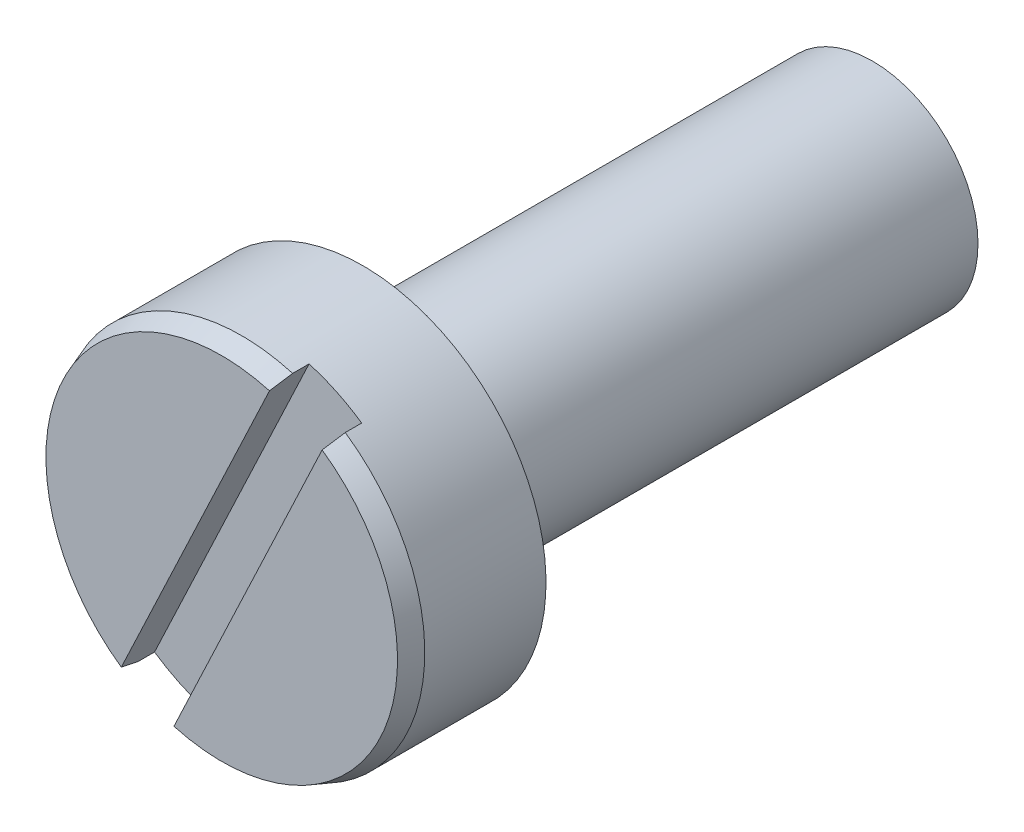
ISO-10303-21;
HEADER;
FILE_DESCRIPTION(('STEP AP214'),'2;1');
FILE_NAME('part.step','',(''),(''),'','','');
FILE_SCHEMA(('AUTOMOTIVE_DESIGN { 1 0 10303 214 1 1 1 1 }'));
ENDSEC;
DATA;
#1=APPLICATION_CONTEXT('core data for automotive mechanical design processes');
#2=APPLICATION_PROTOCOL_DEFINITION('international standard','automotive_design',2000,#1);
#3=PRODUCT_CONTEXT('',#1,'mechanical');
#4=PRODUCT('Part','Part','',(#3));
#5=PRODUCT_RELATED_PRODUCT_CATEGORY('part','',(#4));
#6=PRODUCT_DEFINITION_FORMATION('','',#4);
#7=PRODUCT_DEFINITION_CONTEXT('part definition',#1,'design');
#8=PRODUCT_DEFINITION('design','',#6,#7);
#9=PRODUCT_DEFINITION_SHAPE('','',#8);
#10=(LENGTH_UNIT() NAMED_UNIT(*) SI_UNIT(.MILLI.,.METRE.));
#11=(NAMED_UNIT(*) PLANE_ANGLE_UNIT() SI_UNIT($,.RADIAN.));
#12=(NAMED_UNIT(*) SI_UNIT($,.STERADIAN.) SOLID_ANGLE_UNIT());
#13=UNCERTAINTY_MEASURE_WITH_UNIT(LENGTH_MEASURE(1.E-05),#10,'distance_accuracy_value','');
#14=(GEOMETRIC_REPRESENTATION_CONTEXT(3) GLOBAL_UNCERTAINTY_ASSIGNED_CONTEXT((#13)) GLOBAL_UNIT_ASSIGNED_CONTEXT((#10,
#11,#12)) REPRESENTATION_CONTEXT('',''));
#15=CARTESIAN_POINT('',(0.,0.,0.));
#16=DIRECTION('',(0.,0.,1.));
#17=DIRECTION('',(1.,0.,0.));
#18=AXIS2_PLACEMENT_3D('',#15,#16,#17);
#19=CARTESIAN_POINT('',(7.63219809679219,-23.3190386158975,19.8000000000004));
#20=DIRECTION('',(0.,0.,-1.));
#21=DIRECTION('',(0.427457329703379,0.904035525453982,0.));
#22=AXIS2_PLACEMENT_3D('',#19,#20,#21);
#23=TOROIDAL_SURFACE('',#22,1.95,0.5);
#24=CARTESIAN_POINT('',(7.63219809679219,-23.3190386158975,19.8000000000004));
#25=DIRECTION('',(0.,0.,-1.));
#26=DIRECTION('',(0.427457329703379,0.904035525453982,0.));
#27=AXIS2_PLACEMENT_3D('',#24,#25,#26);
#28=CIRCLE('',#27,1.45);
#29=CARTESIAN_POINT('',(8.25201122486209,-22.0081871039892,19.8000000000004));
#30=VERTEX_POINT('',#29);
#31=EDGE_CURVE('E11',#30,#30,#28,.T.);
#32=ORIENTED_EDGE('',*,*,#31,.F.);
#33=EDGE_LOOP('',(#32));
#34=FACE_BOUND('',#33,.T.);
#35=CARTESIAN_POINT('',(7.63219809679219,-23.3190386158968,20.3000000000004));
#36=DIRECTION('',(0.,0.,1.));
#37=DIRECTION('',(0.427457329703379,0.904035525453982,0.));
#38=AXIS2_PLACEMENT_3D('',#35,#36,#37);
#39=CIRCLE('',#38,1.95);
#40=CARTESIAN_POINT('',(8.46573988971378,-21.5561693412615,20.3000000000004));
#41=VERTEX_POINT('',#40);
#42=EDGE_CURVE('E125',#41,#41,#39,.T.);
#43=ORIENTED_EDGE('',*,*,#42,.F.);
#44=EDGE_LOOP('',(#43));
#45=FACE_BOUND('',#44,.T.);
#46=ADVANCED_FACE('F17',(#34,#45),#23,.F.);
#47=CARTESIAN_POINT('',(7.63219809679219,-23.3190386158966,13.3000000000004));
#48=DIRECTION('',(0.,0.,1.));
#49=DIRECTION('',(-0.427457329703379,-0.904035525453982,0.));
#50=AXIS2_PLACEMENT_3D('',#47,#48,#49);
#51=CONICAL_SURFACE('',#50,1.175252258055,1.221730476396);
#52=CARTESIAN_POINT('',(7.63219809679219,-23.3190386158966,13.3000000000004));
#53=DIRECTION('',(0.,0.,-1.));
#54=DIRECTION('',(0.427457329703379,0.904035525453982,0.));
#55=AXIS2_PLACEMENT_3D('',#52,#53,#54);
#56=CIRCLE('',#55,1.175252258055);
#57=CARTESIAN_POINT('',(8.13456828874825,-22.2565688232449,13.3000000000004));
#58=VERTEX_POINT('',#57);
#59=EDGE_CURVE('E110',#58,#58,#56,.T.);
#60=ORIENTED_EDGE('',*,*,#59,.F.);
#61=EDGE_LOOP('',(#60));
#62=FACE_BOUND('',#61,.T.);
#63=CARTESIAN_POINT('',(7.63219809679219,-23.3190386158975,13.4000000000004));
#64=DIRECTION('',(0.,0.,1.));
#65=DIRECTION('',(0.427457329703379,0.904035525453982,0.));
#66=AXIS2_PLACEMENT_3D('',#63,#64,#65);
#67=CIRCLE('',#66,1.45);
#68=CARTESIAN_POINT('',(8.25201122486209,-22.0081871039892,13.4000000000004));
#69=VERTEX_POINT('',#68);
#70=EDGE_CURVE('E26',#69,#69,#67,.T.);
#71=ORIENTED_EDGE('',*,*,#70,.F.);
#72=EDGE_LOOP('',(#71));
#73=FACE_BOUND('',#72,.T.);
#74=ADVANCED_FACE('F181',(#62,#73),#51,.T.);
#75=CARTESIAN_POINT('',(7.63219809679219,-23.3190386158968,20.3000000000004));
#76=DIRECTION('',(0.,0.,1.));
#77=DIRECTION('',(-0.427457329703379,-0.904035525453982,0.));
#78=AXIS2_PLACEMENT_3D('',#75,#76,#77);
#79=CONICAL_SURFACE('',#78,2.240252258055,1.221730476396);
#80=CARTESIAN_POINT('',(7.63219809679219,-23.3190386158968,20.3000000000004));
#81=DIRECTION('',(0.,0.,-1.));
#82=DIRECTION('',(0.427457329703379,0.904035525453982,0.));
#83=AXIS2_PLACEMENT_3D('',#80,#81,#82);
#84=CIRCLE('',#83,2.240252258055);
#85=CARTESIAN_POINT('',(8.58981034488235,-21.2937709886366,20.3000000000004));
#86=VERTEX_POINT('',#85);
#87=EDGE_CURVE('E121',#86,#86,#84,.T.);
#88=ORIENTED_EDGE('',*,*,#87,.F.);
#89=EDGE_LOOP('',(#88));
#90=FACE_BOUND('',#89,.T.);
#91=CARTESIAN_POINT('',(7.63219809679219,-23.3190386158966,20.4000000000004));
#92=DIRECTION('',(0.,0.,1.));
#93=DIRECTION('',(0.427457329703379,0.904035525453982,0.));
#94=AXIS2_PLACEMENT_3D('',#91,#92,#93);
#95=CIRCLE('',#94,2.515);
#96=CARTESIAN_POINT('',(8.70725328099619,-21.0453892693799,20.4000000000004));
#97=VERTEX_POINT('',#96);
#98=EDGE_CURVE('E68',#97,#97,#95,.T.);
#99=ORIENTED_EDGE('',*,*,#98,.F.);
#100=EDGE_LOOP('',(#99));
#101=FACE_BOUND('',#100,.T.);
#102=ADVANCED_FACE('F186',(#90,#101),#79,.T.);
#103=CARTESIAN_POINT('',(7.63219809679219,-23.3190386158966,13.3000000000004));
#104=DIRECTION('',(0.,0.,-1.));
#105=DIRECTION('',(0.427457329703379,0.904035525453982,0.));
#106=AXIS2_PLACEMENT_3D('',#103,#104,#105);
#107=CYLINDRICAL_SURFACE('',#106,1.45);
#108=ORIENTED_EDGE('',*,*,#31,.T.);
#109=EDGE_LOOP('',(#108));
#110=FACE_BOUND('',#109,.T.);
#111=ORIENTED_EDGE('',*,*,#70,.T.);
#112=EDGE_LOOP('',(#111));
#113=FACE_BOUND('',#112,.T.);
#114=ADVANCED_FACE('F174',(#110,#113),#107,.T.);
#115=CARTESIAN_POINT('',(7.63219809679219,-23.3190386158966,13.3000000000004));
#116=DIRECTION('',(0.,0.,-1.));
#117=DIRECTION('',(0.427457329703379,0.904035525453982,0.));
#118=AXIS2_PLACEMENT_3D('',#115,#116,#117);
#119=CYLINDRICAL_SURFACE('',#118,2.515);
#120=CARTESIAN_POINT('',(7.63219809679219,-23.3190386158972,21.8400000000004));
#121=DIRECTION('',(0.,0.,-1.));
#122=DIRECTION('',(-0.427457329703369,-0.904035525453986,0.));
#123=AXIS2_PLACEMENT_3D('',#120,#121,#122);
#124=CIRCLE('',#123,2.515);
#125=CARTESIAN_POINT('',(6.93244126624817,-25.73473010657,21.8400000000005));
#126=VERTEX_POINT('',#125);
#127=CARTESIAN_POINT('',(6.20921284588519,-25.3927642428074,21.8400000000005));
#128=VERTEX_POINT('',#127);
#129=EDGE_CURVE('E145',#126,#128,#124,.T.);
#130=ORIENTED_EDGE('',*,*,#129,.T.);
#131=DIRECTION('',(0.,0.,-1.));
#132=VECTOR('',#131,1.);
#133=CARTESIAN_POINT('',(6.20921284588519,-25.3927642428073,13.3000000000004));
#134=LINE('',#133,#132);
#135=CARTESIAN_POINT('',(6.20921284588519,-25.3927642428074,22.0652522580554));
#136=VERTEX_POINT('',#135);
#137=EDGE_CURVE('E64',#136,#128,#134,.T.);
#138=ORIENTED_EDGE('',*,*,#137,.F.);
#139=CARTESIAN_POINT('',(7.63219809679219,-23.3190386158972,22.0652522580554));
#140=DIRECTION('',(0.,0.,-1.));
#141=DIRECTION('',(-0.427457329703379,-0.904035525453982,0.));
#142=AXIS2_PLACEMENT_3D('',#139,#140,#141);
#143=CIRCLE('',#142,2.515);
#144=CARTESIAN_POINT('',(8.33195492733518,-20.9033471252242,22.0652522580554));
#145=VERTEX_POINT('',#144);
#146=EDGE_CURVE('E53',#136,#145,#143,.T.);
#147=ORIENTED_EDGE('',*,*,#146,.T.);
#148=DIRECTION('',(0.,0.,1.));
#149=VECTOR('',#148,1.);
#150=CARTESIAN_POINT('',(8.33195492733518,-20.9033471252237,13.3000000000004));
#151=LINE('',#150,#149);
#152=CARTESIAN_POINT('',(8.33195492733518,-20.9033471252243,21.8400000000005));
#153=VERTEX_POINT('',#152);
#154=EDGE_CURVE('E61',#153,#145,#151,.T.);
#155=ORIENTED_EDGE('',*,*,#154,.F.);
#156=CARTESIAN_POINT('',(7.63219809679219,-23.3190386158972,21.8400000000004));
#157=DIRECTION('',(0.,0.,-1.));
#158=DIRECTION('',(-0.427457329703379,-0.904035525453982,0.));
#159=AXIS2_PLACEMENT_3D('',#156,#157,#158);
#160=CIRCLE('',#159,2.515);
#161=CARTESIAN_POINT('',(9.05518334769817,-21.2453129889872,21.8400000000005));
#162=VERTEX_POINT('',#161);
#163=EDGE_CURVE('E93',#153,#162,#160,.T.);
#164=ORIENTED_EDGE('',*,*,#163,.T.);
#165=DIRECTION('',(0.,0.,-1.));
#166=VECTOR('',#165,1.);
#167=CARTESIAN_POINT('',(9.05518334769817,-21.2453129889866,13.3000000000004));
#168=LINE('',#167,#166);
#169=CARTESIAN_POINT('',(9.05518334769817,-21.2453129889872,22.0652522580554));
#170=VERTEX_POINT('',#169);
#171=EDGE_CURVE('E96',#170,#162,#168,.T.);
#172=ORIENTED_EDGE('',*,*,#171,.F.);
#173=CARTESIAN_POINT('',(6.93244126624817,-25.73473010657,22.0652522580554));
#174=VERTEX_POINT('',#173);
#175=EDGE_CURVE('E106',#170,#174,#143,.T.);
#176=ORIENTED_EDGE('',*,*,#175,.T.);
#177=DIRECTION('',(0.,0.,1.));
#178=VECTOR('',#177,1.);
#179=CARTESIAN_POINT('',(6.93244126624817,-25.73473010657,13.3000000000004));
#180=LINE('',#179,#178);
#181=EDGE_CURVE('E103',#126,#174,#180,.T.);
#182=ORIENTED_EDGE('',*,*,#181,.F.);
#183=EDGE_LOOP('',(#130,#138,#147,#155,#164,#172,#176,#182));
#184=FACE_BOUND('',#183,.T.);
#185=ORIENTED_EDGE('',*,*,#98,.T.);
#186=EDGE_LOOP('',(#185));
#187=FACE_BOUND('',#186,.T.);
#188=ADVANCED_FACE('F56',(#184,#187),#119,.T.);
#189=CARTESIAN_POINT('',(7.63219809679219,-23.3190386158976,22.3400000000004));
#190=DIRECTION('',(0.,0.,1.));
#191=DIRECTION('',(-0.427457329703379,-0.904035525453982,0.));
#192=AXIS2_PLACEMENT_3D('',#189,#190,#191);
#193=PLANE('',#192);
#194=DIRECTION('',(-0.427457329703379,-0.904035525453982,0.));
#195=VECTOR('',#194,1.);
#196=CARTESIAN_POINT('',(5.97273422210717,-25.8928962140016,22.3400000000005));
#197=LINE('',#196,#195);
#198=CARTESIAN_POINT('',(8.28863478912517,-20.9949654954985,22.3400000000005));
#199=VERTEX_POINT('',#198);
#200=CARTESIAN_POINT('',(6.25253298409517,-25.3011458725328,22.3400000000004));
#201=VERTEX_POINT('',#200);
#202=EDGE_CURVE('E76',#199,#201,#197,.T.);
#203=ORIENTED_EDGE('',*,*,#202,.F.);
#204=CARTESIAN_POINT('',(7.63219809679219,-23.3190386158976,22.3400000000004));
#205=DIRECTION('',(0.,0.,1.));
#206=DIRECTION('',(-0.427457329703379,-0.904035525453982,0.));
#207=AXIS2_PLACEMENT_3D('',#204,#205,#206);
#208=CIRCLE('',#207,2.415);
#209=EDGE_CURVE('E36',#199,#201,#208,.T.);
#210=ORIENTED_EDGE('',*,*,#209,.T.);
#211=EDGE_LOOP('',(#203,#210));
#212=FACE_BOUND('',#211,.T.);
#213=ADVANCED_FACE('F163',(#212),#193,.T.);
#214=CARTESIAN_POINT('',(7.63219809679219,-23.3190386158972,22.0652522580554));
#215=DIRECTION('',(0.,0.,-1.));
#216=DIRECTION('',(0.427457329703379,0.904035525453982,0.));
#217=AXIS2_PLACEMENT_3D('',#214,#215,#216);
#218=CONICAL_SURFACE('',#217,2.515,0.349065850399);
#219=CARTESIAN_POINT('',(334.877732713186,669.712916273094,-261.393080578831));
#220=DIRECTION('',(0.904035525452299,-0.427457329706938,1.46077674032882E-12));
#221=DIRECTION('',(-0.401017918661995,-0.848118442749434,0.346236531839547));
#222=AXIS2_PLACEMENT_3D('',#219,#220,#221);
#223=CIRCLE('',#222,819.477595478914);
#224=EDGE_CURVE('E153',#201,#136,#223,.T.);
#225=ORIENTED_EDGE('',*,*,#224,.F.);
#226=ORIENTED_EDGE('',*,*,#209,.F.);
#227=CARTESIAN_POINT('',(-320.336562303543,-716.009022073371,-261.3930783065));
#228=DIRECTION('',(0.904035525453982,-0.427457329703379,0.));
#229=DIRECTION('',(0.401070781773213,0.848230243697522,0.345901260021795));
#230=AXIS2_PLACEMENT_3D('',#227,#228,#229);
#231=CIRCLE('',#230,819.477588912782);
#232=EDGE_CURVE('E71',#145,#199,#231,.T.);
#233=ORIENTED_EDGE('',*,*,#232,.F.);
#234=ORIENTED_EDGE('',*,*,#146,.F.);
#235=EDGE_LOOP('',(#225,#226,#233,#234));
#236=FACE_BOUND('',#235,.T.);
#237=ADVANCED_FACE('F72',(#236),#218,.T.);
#238=DIRECTION('',(0.427457329703379,0.904035525453982,0.));
#239=VECTOR('',#238,1.);
#240=CARTESIAN_POINT('',(6.69596264247016,-26.2348620777643,22.3400000000003));
#241=LINE('',#240,#239);
#242=CARTESIAN_POINT('',(6.97576140445819,-25.6431117362954,22.3400000000004));
#243=VERTEX_POINT('',#242);
#244=CARTESIAN_POINT('',(9.01186320948819,-21.3369313592616,22.3400000000006));
#245=VERTEX_POINT('',#244);
#246=EDGE_CURVE('E246',#243,#245,#241,.T.);
#247=ORIENTED_EDGE('',*,*,#246,.F.);
#248=EDGE_CURVE('E111',#243,#245,#208,.T.);
#249=ORIENTED_EDGE('',*,*,#248,.T.);
#250=EDGE_LOOP('',(#247,#249));
#251=FACE_BOUND('',#250,.T.);
#252=ADVANCED_FACE('F166',(#251),#193,.T.);
#253=CARTESIAN_POINT('',(9.90584744330819,-24.3940938001008,20.3000000000005));
#254=DIRECTION('',(0.,0.,-1.));
#255=DIRECTION('',(0.427457329703379,0.904035525453982,0.));
#256=AXIS2_PLACEMENT_3D('',#253,#254,#255);
#257=PLANE('',#256);
#258=ORIENTED_EDGE('',*,*,#42,.T.);
#259=EDGE_LOOP('',(#258));
#260=FACE_BOUND('',#259,.T.);
#261=ORIENTED_EDGE('',*,*,#87,.T.);
#262=EDGE_LOOP('',(#261));
#263=FACE_BOUND('',#262,.T.);
#264=ADVANCED_FACE('F178',(#260,#263),#257,.T.);
#265=CARTESIAN_POINT('',(8.94304960870018,-23.9388517439666,13.3000000000004));
#266=DIRECTION('',(0.,0.,-1.));
#267=DIRECTION('',(0.427457329703379,0.904035525453982,0.));
#268=AXIS2_PLACEMENT_3D('',#265,#266,#267);
#269=PLANE('',#268);
#270=ORIENTED_EDGE('',*,*,#59,.T.);
#271=EDGE_LOOP('',(#270));
#272=FACE_BOUND('',#271,.T.);
#273=ADVANCED_FACE('F208',(#272),#269,.T.);
#274=CARTESIAN_POINT('',(-319.613336519595,-716.350993504883,-261.393080578849));
#275=DIRECTION('',(-0.904035525452299,0.427457329706938,1.44341947337369E-12));
#276=DIRECTION('',(0.401017918661986,0.848118442749428,0.346236531839572));
#277=AXIS2_PLACEMENT_3D('',#274,#275,#276);
#278=CIRCLE('',#277,819.477595478914);
#279=EDGE_CURVE('E86',#245,#170,#278,.T.);
#280=ORIENTED_EDGE('',*,*,#279,.F.);
#281=ORIENTED_EDGE('',*,*,#248,.F.);
#282=CARTESIAN_POINT('',(335.600958497133,669.370944841582,-261.39307830648));
#283=DIRECTION('',(-0.904035525453982,0.427457329703379,0.));
#284=DIRECTION('',(-0.401070781773222,-0.848230243697527,0.345901260021773));
#285=AXIS2_PLACEMENT_3D('',#282,#283,#284);
#286=CIRCLE('',#285,819.477588912782);
#287=EDGE_CURVE('E115',#174,#243,#286,.T.);
#288=ORIENTED_EDGE('',*,*,#287,.F.);
#289=ORIENTED_EDGE('',*,*,#175,.F.);
#290=EDGE_LOOP('',(#280,#281,#288,#289));
#291=FACE_BOUND('',#290,.T.);
#292=ADVANCED_FACE('F173',(#291),#218,.T.);
#293=CARTESIAN_POINT('',(5.97273422210717,-25.8928962140016,21.8400000000005));
#294=DIRECTION('',(-0.904035525453982,0.427457329703379,0.));
#295=DIRECTION('',(-0.427457329703379,-0.904035525453982,0.));
#296=AXIS2_PLACEMENT_3D('',#293,#294,#295);
#297=PLANE('',#296);
#298=ORIENTED_EDGE('',*,*,#137,.T.);
#299=DIRECTION('',(-0.427457329703379,-0.904035525453982,0.));
#300=VECTOR('',#299,1.);
#301=CARTESIAN_POINT('',(5.97273422210717,-25.8928962140016,21.8400000000005));
#302=LINE('',#301,#300);
#303=EDGE_CURVE('E81',#153,#128,#302,.T.);
#304=ORIENTED_EDGE('',*,*,#303,.F.);
#305=ORIENTED_EDGE('',*,*,#154,.T.);
#306=ORIENTED_EDGE('',*,*,#232,.T.);
#307=ORIENTED_EDGE('',*,*,#202,.T.);
#308=ORIENTED_EDGE('',*,*,#224,.T.);
#309=EDGE_LOOP('',(#298,#304,#305,#306,#307,#308));
#310=FACE_BOUND('',#309,.T.);
#311=ADVANCED_FACE('F79',(#310),#297,.F.);
#312=CARTESIAN_POINT('',(6.69596264247016,-26.2348620777643,21.8400000000003));
#313=DIRECTION('',(0.904035525453982,-0.427457329703379,0.));
#314=DIRECTION('',(0.427457329703379,0.904035525453982,0.));
#315=AXIS2_PLACEMENT_3D('',#312,#313,#314);
#316=PLANE('',#315);
#317=ORIENTED_EDGE('',*,*,#171,.T.);
#318=DIRECTION('',(0.427457329703379,0.904035525453982,0.));
#319=VECTOR('',#318,1.);
#320=CARTESIAN_POINT('',(6.69596264247016,-26.2348620777643,21.8400000000003));
#321=LINE('',#320,#319);
#322=EDGE_CURVE('E97',#126,#162,#321,.T.);
#323=ORIENTED_EDGE('',*,*,#322,.F.);
#324=ORIENTED_EDGE('',*,*,#181,.T.);
#325=ORIENTED_EDGE('',*,*,#287,.T.);
#326=ORIENTED_EDGE('',*,*,#246,.T.);
#327=ORIENTED_EDGE('',*,*,#279,.T.);
#328=EDGE_LOOP('',(#317,#323,#324,#325,#326,#327));
#329=FACE_BOUND('',#328,.T.);
#330=ADVANCED_FACE('F217',(#329),#316,.F.);
#331=CARTESIAN_POINT('',(7.63219809679219,-23.3190386158972,21.8400000000004));
#332=DIRECTION('',(0.,0.,1.));
#333=DIRECTION('',(-0.427457329703379,-0.904035525453982,0.));
#334=AXIS2_PLACEMENT_3D('',#331,#332,#333);
#335=PLANE('',#334);
#336=ORIENTED_EDGE('',*,*,#303,.T.);
#337=ORIENTED_EDGE('',*,*,#129,.F.);
#338=ORIENTED_EDGE('',*,*,#322,.T.);
#339=ORIENTED_EDGE('',*,*,#163,.F.);
#340=EDGE_LOOP('',(#336,#337,#338,#339));
#341=FACE_BOUND('',#340,.T.);
#342=ADVANCED_FACE('F220',(#341),#335,.T.);
#343=CLOSED_SHELL('',(#46,#74,#102,#114,#188,#213,#237,#252,#264,#273,#292,#311,#330,#342));
#344=MANIFOLD_SOLID_BREP('B1',#343);
#345=ADVANCED_BREP_SHAPE_REPRESENTATION('',(#18,#344),#14);
#346=SHAPE_DEFINITION_REPRESENTATION(#9,#345);
ENDSEC;
END-ISO-10303-21;
